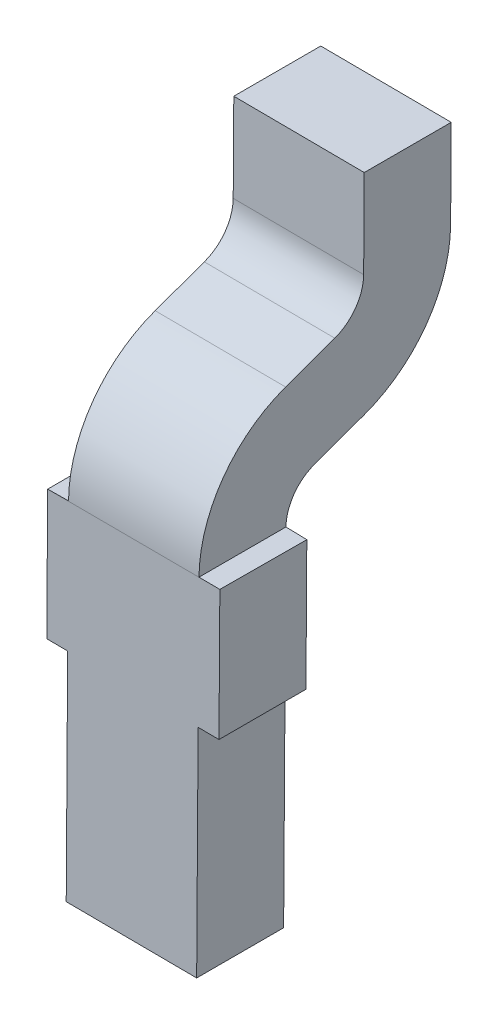
ISO-10303-21;
HEADER;
FILE_DESCRIPTION(('STEP AP214'),'2;1');
FILE_NAME('part.step','',(''),(''),'','','');
FILE_SCHEMA(('AUTOMOTIVE_DESIGN { 1 0 10303 214 1 1 1 1 }'));
ENDSEC;
DATA;
#1=APPLICATION_CONTEXT('core data for automotive mechanical design processes');
#2=APPLICATION_PROTOCOL_DEFINITION('international standard','automotive_design',2000,#1);
#3=PRODUCT_CONTEXT('',#1,'mechanical');
#4=PRODUCT('Part','Part','',(#3));
#5=PRODUCT_RELATED_PRODUCT_CATEGORY('part','',(#4));
#6=PRODUCT_DEFINITION_FORMATION('','',#4);
#7=PRODUCT_DEFINITION_CONTEXT('part definition',#1,'design');
#8=PRODUCT_DEFINITION('design','',#6,#7);
#9=PRODUCT_DEFINITION_SHAPE('','',#8);
#10=(LENGTH_UNIT() NAMED_UNIT(*) SI_UNIT(.MILLI.,.METRE.));
#11=(NAMED_UNIT(*) PLANE_ANGLE_UNIT() SI_UNIT($,.RADIAN.));
#12=(NAMED_UNIT(*) SI_UNIT($,.STERADIAN.) SOLID_ANGLE_UNIT());
#13=UNCERTAINTY_MEASURE_WITH_UNIT(LENGTH_MEASURE(1.E-05),#10,'distance_accuracy_value','');
#14=(GEOMETRIC_REPRESENTATION_CONTEXT(3) GLOBAL_UNCERTAINTY_ASSIGNED_CONTEXT((#13)) GLOBAL_UNIT_ASSIGNED_CONTEXT((#10,
#11,#12)) REPRESENTATION_CONTEXT('',''));
#15=CARTESIAN_POINT('',(0.,0.,0.));
#16=DIRECTION('',(0.,0.,1.));
#17=DIRECTION('',(1.,0.,0.));
#18=AXIS2_PLACEMENT_3D('',#15,#16,#17);
#19=CARTESIAN_POINT('',(204.011590836602,101.63021820341,143.086328634145));
#20=DIRECTION('',(0.99997801670857,-0.00663069374923689,0.));
#21=DIRECTION('',(0.,0.,-1.));
#22=AXIS2_PLACEMENT_3D('',#19,#20,#21);
#23=PLANE('',#22);
#24=DIRECTION('',(0.00663069374923689,0.999978016708569,0.));
#25=VECTOR('',#24,1.);
#26=CARTESIAN_POINT('',(203.999299351482,99.7765336000728,143.151470551509));
#27=LINE('',#26,#25);
#28=CARTESIAN_POINT('',(203.999299351482,99.7765336000728,143.151470551509));
#29=VERTEX_POINT('',#28);
#30=CARTESIAN_POINT('',(204.007602960404,101.02880473421,143.151470551509));
#31=VERTEX_POINT('',#30);
#32=EDGE_CURVE('E67',#29,#31,#27,.T.);
#33=ORIENTED_EDGE('',*,*,#32,.F.);
#34=DIRECTION('',(0.,0.,-1.));
#35=VECTOR('',#34,1.);
#36=CARTESIAN_POINT('',(203.999299351482,99.7765336000728,143.651470551509));
#37=LINE('',#36,#35);
#38=CARTESIAN_POINT('',(203.999299351482,99.7765336000728,143.651470551509));
#39=VERTEX_POINT('',#38);
#40=EDGE_CURVE('E198',#39,#29,#37,.T.);
#41=ORIENTED_EDGE('',*,*,#40,.F.);
#42=DIRECTION('',(-0.00663069374923689,-0.999978016708569,0.));
#43=VECTOR('',#42,1.);
#44=CARTESIAN_POINT('',(204.012560738981,101.77648963349,143.651470551509));
#45=LINE('',#44,#43);
#46=CARTESIAN_POINT('',(204.007602960404,101.02880473421,143.651470551509));
#47=VERTEX_POINT('',#46);
#48=EDGE_CURVE('E278',#47,#39,#45,.T.);
#49=ORIENTED_EDGE('',*,*,#48,.F.);
#50=DIRECTION('',(0.,0.,-1.));
#51=VECTOR('',#50,1.);
#52=CARTESIAN_POINT('',(204.007602960404,101.02880473421,142.648955771372));
#53=LINE('',#52,#51);
#54=EDGE_CURVE('E11',#47,#31,#53,.T.);
#55=ORIENTED_EDGE('',*,*,#54,.T.);
#56=EDGE_LOOP('',(#33,#41,#49,#55));
#57=FACE_BOUND('',#56,.T.);
#58=ADVANCED_FACE('F44',(#57),#23,.F.);
#59=CARTESIAN_POINT('',(205.352573392878,101.019886451118,142.211582908599));
#60=DIRECTION('',(-0.00663069374923689,-0.99997801670857,0.));
#61=DIRECTION('',(-0.99997801670857,0.00663069374923689,0.));
#62=AXIS2_PLACEMENT_3D('',#59,#60,#61);
#63=PLANE('',#62);
#64=ORIENTED_EDGE('',*,*,#54,.F.);
#65=DIRECTION('',(0.999978016708569,-0.00663069374923689,0.));
#66=VECTOR('',#65,1.);
#67=CARTESIAN_POINT('',(205.115078613909,101.021461240883,143.651470551509));
#68=LINE('',#67,#66);
#69=CARTESIAN_POINT('',(203.887605598399,101.02960041746,143.651470551509));
#70=VERTEX_POINT('',#69);
#71=EDGE_CURVE('E304',#70,#47,#68,.T.);
#72=ORIENTED_EDGE('',*,*,#71,.F.);
#73=DIRECTION('',(0.,0.,-1.));
#74=VECTOR('',#73,1.);
#75=CARTESIAN_POINT('',(203.887605598399,101.02960041746,142.648955771372));
#76=LINE('',#75,#74);
#77=CARTESIAN_POINT('',(203.887605598399,101.02960041746,143.151470551509));
#78=VERTEX_POINT('',#77);
#79=EDGE_CURVE('E55',#70,#78,#76,.T.);
#80=ORIENTED_EDGE('',*,*,#79,.T.);
#81=DIRECTION('',(-0.999978016708569,0.00663069374923689,0.));
#82=VECTOR('',#81,1.);
#83=CARTESIAN_POINT('',(205.115078613909,101.021461240883,143.151470551509));
#84=LINE('',#83,#82);
#85=EDGE_CURVE('E270',#31,#78,#84,.T.);
#86=ORIENTED_EDGE('',*,*,#85,.F.);
#87=EDGE_LOOP('',(#64,#72,#80,#86));
#88=FACE_BOUND('',#87,.T.);
#89=ADVANCED_FACE('F500',(#88),#63,.T.);
#90=CARTESIAN_POINT('',(203.891593474597,101.63101388666,143.086328634145));
#91=DIRECTION('',(0.99997801670857,-0.00663069374923689,0.));
#92=DIRECTION('',(0.,0.,-1.));
#93=AXIS2_PLACEMENT_3D('',#90,#91,#92);
#94=PLANE('',#93);
#95=DIRECTION('',(0.00663069374923689,0.999978016708569,0.));
#96=VECTOR('',#95,1.);
#97=CARTESIAN_POINT('',(203.879301989477,99.7773292833227,143.151470551509));
#98=LINE('',#97,#96);
#99=CARTESIAN_POINT('',(203.892563376976,101.77728531674,143.151470551509));
#100=VERTEX_POINT('',#99);
#101=EDGE_CURVE('E274',#78,#100,#98,.T.);
#102=ORIENTED_EDGE('',*,*,#101,.F.);
#103=ORIENTED_EDGE('',*,*,#79,.F.);
#104=DIRECTION('',(-0.00663069374923689,-0.999978016708569,0.));
#105=VECTOR('',#104,1.);
#106=CARTESIAN_POINT('',(203.892563376976,101.77728531674,143.651470551509));
#107=LINE('',#106,#105);
#108=CARTESIAN_POINT('',(203.892563376976,101.77728531674,143.651470551509));
#109=VERTEX_POINT('',#108);
#110=EDGE_CURVE('E308',#109,#70,#107,.T.);
#111=ORIENTED_EDGE('',*,*,#110,.F.);
#112=DIRECTION('',(0.,0.,1.));
#113=VECTOR('',#112,1.);
#114=CARTESIAN_POINT('',(203.892578618711,101.779583929992,142.648955771372));
#115=LINE('',#114,#113);
#116=EDGE_CURVE('E353',#100,#109,#115,.T.);
#117=ORIENTED_EDGE('',*,*,#116,.F.);
#118=EDGE_LOOP('',(#102,#103,#111,#117));
#119=FACE_BOUND('',#118,.T.);
#120=ADVANCED_FACE('F421',(#119),#94,.F.);
#121=CARTESIAN_POINT('',(198.857689304583,101.812969473019,142.211582908599));
#122=DIRECTION('',(0.00663069374923689,0.99997801670857,0.));
#123=DIRECTION('',(0.,0.,-1.));
#124=AXIS2_PLACEMENT_3D('',#121,#122,#123);
#125=PLANE('',#124);
#126=DIRECTION('',(0.,0.,1.));
#127=VECTOR('',#126,1.);
#128=CARTESIAN_POINT('',(204.012575980716,101.778788246742,142.648955771372));
#129=LINE('',#128,#127);
#130=CARTESIAN_POINT('',(204.012575980716,101.778788246742,143.151459983575));
#131=VERTEX_POINT('',#130);
#132=CARTESIAN_POINT('',(204.012575980716,101.778788246742,143.651467028931));
#133=VERTEX_POINT('',#132);
#134=EDGE_CURVE('E240',#131,#133,#129,.T.);
#135=ORIENTED_EDGE('',*,*,#134,.F.);
#136=DIRECTION('',(0.999978016708569,-0.00663069374923689,0.));
#137=VECTOR('',#136,1.);
#138=CARTESIAN_POINT('',(204.882556855252,101.77301954318,143.151459983575));
#139=LINE('',#138,#137);
#140=EDGE_CURVE('E323',#100,#131,#139,.T.);
#141=ORIENTED_EDGE('',*,*,#140,.F.);
#142=ORIENTED_EDGE('',*,*,#116,.T.);
#143=DIRECTION('',(0.999978016708569,-0.00663069374923689,0.));
#144=VECTOR('',#143,1.);
#145=CARTESIAN_POINT('',(204.882556855252,101.77301954318,143.651467028931));
#146=LINE('',#145,#144);
#147=EDGE_CURVE('E251',#109,#133,#146,.T.);
#148=ORIENTED_EDGE('',*,*,#147,.T.);
#149=EDGE_LOOP('',(#135,#141,#142,#148));
#150=FACE_BOUND('',#149,.T.);
#151=ADVANCED_FACE('F425',(#150),#125,.T.);
#152=CARTESIAN_POINT('',(204.011590836602,101.63021820341,143.086328634145));
#153=DIRECTION('',(0.99997801670857,-0.00663069374923689,0.));
#154=DIRECTION('',(0.,0.,-1.));
#155=AXIS2_PLACEMENT_3D('',#152,#153,#154);
#156=PLANE('',#155);
#157=DIRECTION('',(0.00663069374923689,0.999978016708569,0.));
#158=VECTOR('',#157,1.);
#159=CARTESIAN_POINT('',(204.019471902216,102.818765384119,142.211582908599));
#160=LINE('',#159,#158);
#161=CARTESIAN_POINT('',(204.019471902216,102.818765384119,142.211582908599));
#162=VERTEX_POINT('',#161);
#163=CARTESIAN_POINT('',(204.022853556027,103.32875417264,142.211582908599));
#164=VERTEX_POINT('',#163);
#165=EDGE_CURVE('E230',#162,#164,#160,.T.);
#166=ORIENTED_EDGE('',*,*,#165,.F.);
#167=CARTESIAN_POINT('',(204.019471902216,102.818765384119,142.961582908599));
#168=DIRECTION('',(0.99997801670857,-0.00663069374922598,0.));
#169=DIRECTION('',(-0.00623081398683692,-0.939671963249076,-0.342020143325928));
#170=AXIS2_PLACEMENT_3D('',#167,#168,#169);
#171=CIRCLE('',#170,0.749999999999992);
#172=CARTESIAN_POINT('',(204.014798791725,102.114011411682,142.705067801105));
#173=VERTEX_POINT('',#172);
#174=EDGE_CURVE('E160',#173,#162,#171,.T.);
#175=ORIENTED_EDGE('',*,*,#174,.F.);
#176=DIRECTION('',(0.00226783082646436,0.342012624597446,-0.939692620785813));
#177=VECTOR('',#176,1.);
#178=CARTESIAN_POINT('',(204.014118442477,102.011407624303,142.986975587341));
#179=LINE('',#178,#177);
#180=CARTESIAN_POINT('',(204.014118442477,102.011407624303,142.986975587341));
#181=VERTEX_POINT('',#180);
#182=EDGE_CURVE('E232',#181,#173,#179,.T.);
#183=ORIENTED_EDGE('',*,*,#182,.F.);
#184=CARTESIAN_POINT('',(204.012560738981,101.77648963349,142.901470551509));
#185=DIRECTION('',(-0.99997801670857,0.00663069374923689,0.));
#186=DIRECTION('',(0.,0.,1.));
#187=AXIS2_PLACEMENT_3D('',#184,#185,#186);
#188=CIRCLE('',#187,0.25);
#189=EDGE_CURVE('E172',#131,#181,#188,.T.);
#190=ORIENTED_EDGE('',*,*,#189,.F.);
#191=ORIENTED_EDGE('',*,*,#134,.T.);
#192=CARTESIAN_POINT('',(204.012560738981,101.77648963349,142.901470551509));
#193=DIRECTION('',(0.99997801670857,-0.00663069374922598,0.));
#194=DIRECTION('',(0.00623081398683692,0.939671963249076,0.342020143325928));
#195=AXIS2_PLACEMENT_3D('',#192,#193,#194);
#196=CIRCLE('',#195,0.749999999999992);
#197=CARTESIAN_POINT('',(204.017233849471,102.481243605927,143.157985659003));
#198=VERTEX_POINT('',#197);
#199=EDGE_CURVE('E292',#198,#133,#196,.T.);
#200=ORIENTED_EDGE('',*,*,#199,.F.);
#201=DIRECTION('',(-0.00226783082646436,-0.342012624597446,0.939692620785813));
#202=VECTOR('',#201,1.);
#203=CARTESIAN_POINT('',(204.017914198719,102.583847393307,142.876077872768));
#204=LINE('',#203,#202);
#205=CARTESIAN_POINT('',(204.017914198719,102.583847393307,142.876077872768));
#206=VERTEX_POINT('',#205);
#207=EDGE_CURVE('E265',#206,#198,#204,.T.);
#208=ORIENTED_EDGE('',*,*,#207,.F.);
#209=CARTESIAN_POINT('',(204.019471902216,102.818765384119,142.961582908599));
#210=DIRECTION('',(-0.99997801670857,0.00663069374923689,0.));
#211=DIRECTION('',(0.,0.,-1.));
#212=AXIS2_PLACEMENT_3D('',#209,#210,#211);
#213=CIRCLE('',#212,0.25);
#214=CARTESIAN_POINT('',(204.019471902216,102.818765384119,142.711582908599));
#215=VERTEX_POINT('',#214);
#216=EDGE_CURVE('E260',#215,#206,#213,.T.);
#217=ORIENTED_EDGE('',*,*,#216,.F.);
#218=DIRECTION('',(-0.00663069374923689,-0.999978016708569,0.));
#219=VECTOR('',#218,1.);
#220=CARTESIAN_POINT('',(204.022853556027,103.32875417264,142.711582908599));
#221=LINE('',#220,#219);
#222=CARTESIAN_POINT('',(204.022853556027,103.32875417264,142.711582908599));
#223=VERTEX_POINT('',#222);
#224=EDGE_CURVE('E241',#223,#215,#221,.T.);
#225=ORIENTED_EDGE('',*,*,#224,.F.);
#226=DIRECTION('',(0.,0.,1.));
#227=VECTOR('',#226,1.);
#228=CARTESIAN_POINT('',(204.022853556027,103.32875417264,142.211582908599));
#229=LINE('',#228,#227);
#230=EDGE_CURVE('E331',#164,#223,#229,.T.);
#231=ORIENTED_EDGE('',*,*,#230,.F.);
#232=EDGE_LOOP('',(#166,#175,#183,#190,#191,#200,#208,#217,#225,#231));
#233=FACE_BOUND('',#232,.T.);
#234=ADVANCED_FACE('F462',(#233),#156,.F.);
#235=CARTESIAN_POINT('',(204.772837068559,103.323781152328,142.711582908599));
#236=DIRECTION('',(0.,0.,1.));
#237=DIRECTION('',(1.,0.,0.));
#238=AXIS2_PLACEMENT_3D('',#235,#236,#237);
#239=PLANE('',#238);
#240=DIRECTION('',(-0.999978016708569,0.00663069374923689,0.));
#241=VECTOR('',#240,1.);
#242=CARTESIAN_POINT('',(204.772837068559,103.323781152328,142.711582908599));
#243=LINE('',#242,#241);
#244=CARTESIAN_POINT('',(204.772837068559,103.323781152328,142.711582908599));
#245=VERTEX_POINT('',#244);
#246=EDGE_CURVE('E236',#245,#223,#243,.T.);
#247=ORIENTED_EDGE('',*,*,#246,.T.);
#248=ORIENTED_EDGE('',*,*,#224,.T.);
#249=DIRECTION('',(-0.999978016708569,0.00663069374923689,0.));
#250=VECTOR('',#249,1.);
#251=CARTESIAN_POINT('',(204.769455414747,102.813792363807,142.711582908599));
#252=LINE('',#251,#250);
#253=CARTESIAN_POINT('',(204.769455414747,102.813792363807,142.711582908599));
#254=VERTEX_POINT('',#253);
#255=EDGE_CURVE('E256',#254,#215,#252,.T.);
#256=ORIENTED_EDGE('',*,*,#255,.F.);
#257=DIRECTION('',(-0.00663069374923689,-0.999978016708569,0.));
#258=VECTOR('',#257,1.);
#259=CARTESIAN_POINT('',(204.772837068559,103.323781152328,142.711582908599));
#260=LINE('',#259,#258);
#261=EDGE_CURVE('E264',#245,#254,#260,.T.);
#262=ORIENTED_EDGE('',*,*,#261,.F.);
#263=EDGE_LOOP('',(#247,#248,#256,#262));
#264=FACE_BOUND('',#263,.T.);
#265=ADVANCED_FACE('F543',(#264),#239,.T.);
#266=CARTESIAN_POINT('',(204.769455414747,102.813792363807,142.961582908599));
#267=DIRECTION('',(0.99997801670857,-0.00663069374923689,0.));
#268=DIRECTION('',(0.,0.,-1.));
#269=AXIS2_PLACEMENT_3D('',#266,#267,#268);
#270=CYLINDRICAL_SURFACE('',#269,0.25);
#271=ORIENTED_EDGE('',*,*,#255,.T.);
#272=ORIENTED_EDGE('',*,*,#216,.T.);
#273=DIRECTION('',(-0.999978016708569,0.00663069374923689,0.));
#274=VECTOR('',#273,1.);
#275=CARTESIAN_POINT('',(204.76789771125,102.578874372995,142.876077872768));
#276=LINE('',#275,#274);
#277=CARTESIAN_POINT('',(204.76789771125,102.578874372995,142.876077872768));
#278=VERTEX_POINT('',#277);
#279=EDGE_CURVE('E269',#278,#206,#276,.T.);
#280=ORIENTED_EDGE('',*,*,#279,.F.);
#281=CARTESIAN_POINT('',(204.769455414747,102.813792363807,142.961582908599));
#282=DIRECTION('',(-0.99997801670857,0.00663069374923689,0.));
#283=DIRECTION('',(0.,0.,-1.));
#284=AXIS2_PLACEMENT_3D('',#281,#282,#283);
#285=CIRCLE('',#284,0.25);
#286=EDGE_CURVE('E246',#254,#278,#285,.T.);
#287=ORIENTED_EDGE('',*,*,#286,.F.);
#288=EDGE_LOOP('',(#271,#272,#280,#287));
#289=FACE_BOUND('',#288,.T.);
#290=ADVANCED_FACE('F538',(#289),#270,.F.);
#291=CARTESIAN_POINT('',(204.76789771125,102.578874372995,142.876077872768));
#292=DIRECTION('',(0.00623081398684852,0.939671963249075,0.342020143325932));
#293=DIRECTION('',(0.99983409933677,0.,-0.0182146590259127));
#294=AXIS2_PLACEMENT_3D('',#291,#292,#293);
#295=PLANE('',#294);
#296=ORIENTED_EDGE('',*,*,#279,.T.);
#297=ORIENTED_EDGE('',*,*,#207,.T.);
#298=DIRECTION('',(-0.999978016708569,0.00663069374923689,0.));
#299=VECTOR('',#298,1.);
#300=CARTESIAN_POINT('',(204.767217362002,102.476270585615,143.157985659003));
#301=LINE('',#300,#299);
#302=CARTESIAN_POINT('',(204.767217362002,102.476270585615,143.157985659003));
#303=VERTEX_POINT('',#302);
#304=EDGE_CURVE('E296',#303,#198,#301,.T.);
#305=ORIENTED_EDGE('',*,*,#304,.F.);
#306=DIRECTION('',(-0.00226783082646436,-0.342012624597446,0.939692620785813));
#307=VECTOR('',#306,1.);
#308=CARTESIAN_POINT('',(204.76789771125,102.578874372995,142.876077872768));
#309=LINE('',#308,#307);
#310=EDGE_CURVE('E242',#278,#303,#309,.T.);
#311=ORIENTED_EDGE('',*,*,#310,.F.);
#312=EDGE_LOOP('',(#296,#297,#305,#311));
#313=FACE_BOUND('',#312,.T.);
#314=ADVANCED_FACE('F532',(#313),#295,.T.);
#315=CARTESIAN_POINT('',(204.764101955009,102.006434603991,142.986975587341));
#316=DIRECTION('',(-0.00623081398684852,-0.939671963249075,-0.342020143325932));
#317=DIRECTION('',(0.,0.342026782650606,-0.939690204242693));
#318=AXIS2_PLACEMENT_3D('',#315,#316,#317);
#319=PLANE('',#318);
#320=DIRECTION('',(-0.999978016708569,0.00663069374923689,0.));
#321=VECTOR('',#320,1.);
#322=CARTESIAN_POINT('',(204.764101955009,102.006434603991,142.986975587341));
#323=LINE('',#322,#321);
#324=CARTESIAN_POINT('',(204.764101955009,102.006434603991,142.986975587341));
#325=VERTEX_POINT('',#324);
#326=EDGE_CURVE('E234',#325,#181,#323,.T.);
#327=ORIENTED_EDGE('',*,*,#326,.T.);
#328=ORIENTED_EDGE('',*,*,#182,.T.);
#329=DIRECTION('',(-0.999978016708569,0.00663069374923689,0.));
#330=VECTOR('',#329,1.);
#331=CARTESIAN_POINT('',(204.764782304257,102.10903839137,142.705067801105));
#332=LINE('',#331,#330);
#333=CARTESIAN_POINT('',(204.764782304257,102.10903839137,142.705067801105));
#334=VERTEX_POINT('',#333);
#335=EDGE_CURVE('E235',#334,#173,#332,.T.);
#336=ORIENTED_EDGE('',*,*,#335,.F.);
#337=DIRECTION('',(0.00226783082646436,0.342012624597446,-0.939692620785813));
#338=VECTOR('',#337,1.);
#339=CARTESIAN_POINT('',(204.764101955009,102.006434603991,142.986975587341));
#340=LINE('',#339,#338);
#341=EDGE_CURVE('E298',#325,#334,#340,.T.);
#342=ORIENTED_EDGE('',*,*,#341,.F.);
#343=EDGE_LOOP('',(#327,#328,#336,#342));
#344=FACE_BOUND('',#343,.T.);
#345=ADVANCED_FACE('F490',(#344),#319,.T.);
#346=CARTESIAN_POINT('',(204.769455414747,102.813792363807,142.961582908599));
#347=DIRECTION('',(0.99997801670857,-0.00663069374922598,0.));
#348=DIRECTION('',(-0.00623081398683692,-0.939671963249076,-0.342020143325928));
#349=AXIS2_PLACEMENT_3D('',#346,#347,#348);
#350=CYLINDRICAL_SURFACE('',#349,0.749999999999992);
#351=ORIENTED_EDGE('',*,*,#335,.T.);
#352=ORIENTED_EDGE('',*,*,#174,.T.);
#353=DIRECTION('',(-0.999978016708569,0.00663069374923689,0.));
#354=VECTOR('',#353,1.);
#355=CARTESIAN_POINT('',(204.769455414747,102.813792363807,142.211582908599));
#356=LINE('',#355,#354);
#357=CARTESIAN_POINT('',(204.769455414747,102.813792363807,142.211582908599));
#358=VERTEX_POINT('',#357);
#359=EDGE_CURVE('E314',#358,#162,#356,.T.);
#360=ORIENTED_EDGE('',*,*,#359,.F.);
#361=CARTESIAN_POINT('',(204.769455414747,102.813792363807,142.961582908599));
#362=DIRECTION('',(0.99997801670857,-0.00663069374922598,0.));
#363=DIRECTION('',(-0.00623081398683692,-0.939671963249076,-0.342020143325928));
#364=AXIS2_PLACEMENT_3D('',#361,#362,#363);
#365=CIRCLE('',#364,0.749999999999992);
#366=EDGE_CURVE('E303',#334,#358,#365,.T.);
#367=ORIENTED_EDGE('',*,*,#366,.F.);
#368=EDGE_LOOP('',(#351,#352,#360,#367));
#369=FACE_BOUND('',#368,.T.);
#370=ADVANCED_FACE('F531',(#369),#350,.T.);
#371=CARTESIAN_POINT('',(204.769455414747,102.813792363807,142.211582908599));
#372=DIRECTION('',(0.,0.,-1.));
#373=DIRECTION('',(0.,-1.,0.));
#374=AXIS2_PLACEMENT_3D('',#371,#372,#373);
#375=PLANE('',#374);
#376=ORIENTED_EDGE('',*,*,#359,.T.);
#377=ORIENTED_EDGE('',*,*,#165,.T.);
#378=DIRECTION('',(-0.999978016708569,0.00663069374923689,0.));
#379=VECTOR('',#378,1.);
#380=CARTESIAN_POINT('',(204.772837068559,103.323781152328,142.211582908599));
#381=LINE('',#380,#379);
#382=CARTESIAN_POINT('',(204.772837068559,103.323781152328,142.211582908599));
#383=VERTEX_POINT('',#382);
#384=EDGE_CURVE('E347',#383,#164,#381,.T.);
#385=ORIENTED_EDGE('',*,*,#384,.F.);
#386=DIRECTION('',(0.00663069374923689,0.999978016708569,0.));
#387=VECTOR('',#386,1.);
#388=CARTESIAN_POINT('',(204.769455414747,102.813792363807,142.211582908599));
#389=LINE('',#388,#387);
#390=EDGE_CURVE('E185',#358,#383,#389,.T.);
#391=ORIENTED_EDGE('',*,*,#390,.F.);
#392=EDGE_LOOP('',(#376,#377,#385,#391));
#393=FACE_BOUND('',#392,.T.);
#394=ADVANCED_FACE('F469',(#393),#375,.T.);
#395=CARTESIAN_POINT('',(204.772837068559,103.323781152328,142.211582908599));
#396=DIRECTION('',(0.00663069374923689,0.99997801670857,0.));
#397=DIRECTION('',(2.67899092701187E-13,0.,-1.));
#398=AXIS2_PLACEMENT_3D('',#395,#396,#397);
#399=PLANE('',#398);
#400=ORIENTED_EDGE('',*,*,#384,.T.);
#401=ORIENTED_EDGE('',*,*,#230,.T.);
#402=ORIENTED_EDGE('',*,*,#246,.F.);
#403=DIRECTION('',(0.,0.,1.));
#404=VECTOR('',#403,1.);
#405=CARTESIAN_POINT('',(204.772837068559,103.323781152328,142.211582908599));
#406=LINE('',#405,#404);
#407=EDGE_CURVE('E280',#383,#245,#406,.T.);
#408=ORIENTED_EDGE('',*,*,#407,.F.);
#409=EDGE_LOOP('',(#400,#401,#402,#408));
#410=FACE_BOUND('',#409,.T.);
#411=ADVANCED_FACE('F472',(#410),#399,.T.);
#412=CARTESIAN_POINT('',(204.749282864013,99.7715605797609,143.651470551509));
#413=DIRECTION('',(-0.00663069374923689,-0.99997801670857,0.));
#414=DIRECTION('',(-0.99997801670857,0.00663069374923689,0.));
#415=AXIS2_PLACEMENT_3D('',#412,#413,#414);
#416=PLANE('',#415);
#417=DIRECTION('',(-0.999978016708569,0.00663069374923689,0.));
#418=VECTOR('',#417,1.);
#419=CARTESIAN_POINT('',(204.749282864013,99.7715605797609,143.651470551509));
#420=LINE('',#419,#418);
#421=CARTESIAN_POINT('',(204.749282864013,99.7715605797609,143.651470551509));
#422=VERTEX_POINT('',#421);
#423=EDGE_CURVE('E285',#422,#39,#420,.T.);
#424=ORIENTED_EDGE('',*,*,#423,.T.);
#425=ORIENTED_EDGE('',*,*,#40,.T.);
#426=DIRECTION('',(-0.999978016708569,0.00663069374923689,0.));
#427=VECTOR('',#426,1.);
#428=CARTESIAN_POINT('',(204.749282864013,99.7715605797609,143.151470551509));
#429=LINE('',#428,#427);
#430=CARTESIAN_POINT('',(204.749282864013,99.7715605797609,143.151470551509));
#431=VERTEX_POINT('',#430);
#432=EDGE_CURVE('E192',#431,#29,#429,.T.);
#433=ORIENTED_EDGE('',*,*,#432,.F.);
#434=DIRECTION('',(0.,0.,-1.));
#435=VECTOR('',#434,1.);
#436=CARTESIAN_POINT('',(204.749282864013,99.7715605797609,143.651470551509));
#437=LINE('',#436,#435);
#438=EDGE_CURVE('E196',#422,#431,#437,.T.);
#439=ORIENTED_EDGE('',*,*,#438,.F.);
#440=EDGE_LOOP('',(#424,#425,#433,#439));
#441=FACE_BOUND('',#440,.T.);
#442=ADVANCED_FACE('F195',(#441),#416,.T.);
#443=CARTESIAN_POINT('',(204.761574349133,101.625245183098,143.086328634145));
#444=DIRECTION('',(0.99997801670857,-0.00663069374923689,0.));
#445=DIRECTION('',(0.,0.,-1.));
#446=AXIS2_PLACEMENT_3D('',#443,#444,#445);
#447=PLANE('',#446);
#448=ORIENTED_EDGE('',*,*,#407,.T.);
#449=ORIENTED_EDGE('',*,*,#261,.T.);
#450=ORIENTED_EDGE('',*,*,#286,.T.);
#451=ORIENTED_EDGE('',*,*,#310,.T.);
#452=CARTESIAN_POINT('',(204.762544251512,101.771516613178,142.901470551509));
#453=DIRECTION('',(0.99997801670857,-0.00663069374922598,0.));
#454=DIRECTION('',(0.00623081398683692,0.939671963249076,0.342020143325928));
#455=AXIS2_PLACEMENT_3D('',#452,#453,#454);
#456=CIRCLE('',#455,0.749999999999992);
#457=CARTESIAN_POINT('',(204.762559493247,101.77381522643,143.651467028931));
#458=VERTEX_POINT('',#457);
#459=EDGE_CURVE('E247',#303,#458,#456,.T.);
#460=ORIENTED_EDGE('',*,*,#459,.T.);
#461=DIRECTION('',(0.,0.,1.));
#462=VECTOR('',#461,1.);
#463=CARTESIAN_POINT('',(204.762559493247,101.77381522643,142.648955771372));
#464=LINE('',#463,#462);
#465=CARTESIAN_POINT('',(204.762559493247,101.77381522643,143.151459983575));
#466=VERTEX_POINT('',#465);
#467=EDGE_CURVE('E219',#466,#458,#464,.T.);
#468=ORIENTED_EDGE('',*,*,#467,.F.);
#469=CARTESIAN_POINT('',(204.762544251512,101.771516613178,142.901470551509));
#470=DIRECTION('',(-0.99997801670857,0.00663069374923689,0.));
#471=DIRECTION('',(0.,0.,1.));
#472=AXIS2_PLACEMENT_3D('',#469,#470,#471);
#473=CIRCLE('',#472,0.25);
#474=EDGE_CURVE('E302',#466,#325,#473,.T.);
#475=ORIENTED_EDGE('',*,*,#474,.T.);
#476=ORIENTED_EDGE('',*,*,#341,.T.);
#477=ORIENTED_EDGE('',*,*,#366,.T.);
#478=ORIENTED_EDGE('',*,*,#390,.T.);
#479=EDGE_LOOP('',(#448,#449,#450,#451,#460,#468,#475,#476,#477,#478));
#480=FACE_BOUND('',#479,.T.);
#481=ADVANCED_FACE('F435',(#480),#447,.T.);
#482=CARTESIAN_POINT('',(204.761574349133,101.625245183098,143.086328634145));
#483=DIRECTION('',(0.99997801670857,-0.00663069374923689,0.));
#484=DIRECTION('',(0.,0.,-1.));
#485=AXIS2_PLACEMENT_3D('',#482,#483,#484);
#486=PLANE('',#485);
#487=DIRECTION('',(0.,0.,-1.));
#488=VECTOR('',#487,1.);
#489=CARTESIAN_POINT('',(204.757586472935,101.023831713898,142.648955771372));
#490=LINE('',#489,#488);
#491=CARTESIAN_POINT('',(204.757586472935,101.023831713898,143.651470551509));
#492=VERTEX_POINT('',#491);
#493=CARTESIAN_POINT('',(204.757586472935,101.023831713898,143.151470551509));
#494=VERTEX_POINT('',#493);
#495=EDGE_CURVE('E279',#492,#494,#490,.T.);
#496=ORIENTED_EDGE('',*,*,#495,.F.);
#497=DIRECTION('',(-0.00663069374923689,-0.999978016708569,0.));
#498=VECTOR('',#497,1.);
#499=CARTESIAN_POINT('',(204.762544251512,101.771516613178,143.651470551509));
#500=LINE('',#499,#498);
#501=EDGE_CURVE('E212',#492,#422,#500,.T.);
#502=ORIENTED_EDGE('',*,*,#501,.T.);
#503=ORIENTED_EDGE('',*,*,#438,.T.);
#504=DIRECTION('',(0.00663069374923689,0.999978016708569,0.));
#505=VECTOR('',#504,1.);
#506=CARTESIAN_POINT('',(204.749282864013,99.7715605797609,143.151470551509));
#507=LINE('',#506,#505);
#508=EDGE_CURVE('E209',#431,#494,#507,.T.);
#509=ORIENTED_EDGE('',*,*,#508,.T.);
#510=EDGE_LOOP('',(#496,#502,#503,#509));
#511=FACE_BOUND('',#510,.T.);
#512=ADVANCED_FACE('F208',(#511),#486,.T.);
#513=CARTESIAN_POINT('',(198.857689304583,101.812969473019,142.211582908599));
#514=DIRECTION('',(0.00663069374923689,0.99997801670857,0.));
#515=DIRECTION('',(0.,0.,-1.));
#516=AXIS2_PLACEMENT_3D('',#513,#514,#515);
#517=PLANE('',#516);
#518=DIRECTION('',(0.,0.,1.));
#519=VECTOR('',#518,1.);
#520=CARTESIAN_POINT('',(204.882556855252,101.77301954318,142.648955771372));
#521=LINE('',#520,#519);
#522=CARTESIAN_POINT('',(204.882541613517,101.770720929928,143.151470551509));
#523=VERTEX_POINT('',#522);
#524=CARTESIAN_POINT('',(204.882556855252,101.77301954318,143.651467028931));
#525=VERTEX_POINT('',#524);
#526=EDGE_CURVE('E106',#523,#525,#521,.T.);
#527=ORIENTED_EDGE('',*,*,#526,.F.);
#528=DIRECTION('',(0.999978016708569,-0.00663069374923689,0.));
#529=VECTOR('',#528,1.);
#530=CARTESIAN_POINT('',(204.882556855252,101.77301954318,143.151459983575));
#531=LINE('',#530,#529);
#532=EDGE_CURVE('E324',#466,#523,#531,.T.);
#533=ORIENTED_EDGE('',*,*,#532,.F.);
#534=ORIENTED_EDGE('',*,*,#467,.T.);
#535=DIRECTION('',(0.999978016708569,-0.00663069374923689,0.));
#536=VECTOR('',#535,1.);
#537=CARTESIAN_POINT('',(204.882556855252,101.77301954318,143.651467028931));
#538=LINE('',#537,#536);
#539=EDGE_CURVE('E226',#458,#525,#538,.T.);
#540=ORIENTED_EDGE('',*,*,#539,.T.);
#541=EDGE_LOOP('',(#527,#533,#534,#540));
#542=FACE_BOUND('',#541,.T.);
#543=ADVANCED_FACE('F432',(#542),#517,.T.);
#544=CARTESIAN_POINT('',(204.882541613517,101.770720929928,142.901470551509));
#545=DIRECTION('',(0.99997801670857,-0.00663069374922598,0.));
#546=DIRECTION('',(0.00623081398683692,0.939671963249076,0.342020143325928));
#547=AXIS2_PLACEMENT_3D('',#544,#545,#546);
#548=CYLINDRICAL_SURFACE('',#547,0.749999999999992);
#549=DIRECTION('',(-0.999978016708569,0.00663069374923689,0.));
#550=VECTOR('',#549,1.);
#551=CARTESIAN_POINT('',(204.882541613517,101.770720929928,143.651470551509));
#552=LINE('',#551,#550);
#553=EDGE_CURVE('E297',#525,#109,#552,.T.);
#554=ORIENTED_EDGE('',*,*,#553,.F.);
#555=ORIENTED_EDGE('',*,*,#539,.F.);
#556=ORIENTED_EDGE('',*,*,#459,.F.);
#557=ORIENTED_EDGE('',*,*,#304,.T.);
#558=ORIENTED_EDGE('',*,*,#199,.T.);
#559=ORIENTED_EDGE('',*,*,#147,.F.);
#560=EDGE_LOOP('',(#554,#555,#556,#557,#558,#559));
#561=FACE_BOUND('',#560,.T.);
#562=ADVANCED_FACE('F430',(#561),#548,.T.);
#563=CARTESIAN_POINT('',(204.882541613517,101.770720929928,143.651470551509));
#564=DIRECTION('',(0.,0.,1.));
#565=DIRECTION('',(1.,0.,0.));
#566=AXIS2_PLACEMENT_3D('',#563,#564,#565);
#567=PLANE('',#566);
#568=DIRECTION('',(-0.00663069374923689,-0.999978016708569,0.));
#569=VECTOR('',#568,1.);
#570=CARTESIAN_POINT('',(204.882541613517,101.770720929928,143.651470551509));
#571=LINE('',#570,#569);
#572=CARTESIAN_POINT('',(204.877583834941,101.023036030648,143.651470551509));
#573=VERTEX_POINT('',#572);
#574=EDGE_CURVE('E119',#525,#573,#571,.T.);
#575=ORIENTED_EDGE('',*,*,#574,.F.);
#576=ORIENTED_EDGE('',*,*,#553,.T.);
#577=ORIENTED_EDGE('',*,*,#110,.T.);
#578=ORIENTED_EDGE('',*,*,#71,.T.);
#579=ORIENTED_EDGE('',*,*,#48,.T.);
#580=ORIENTED_EDGE('',*,*,#423,.F.);
#581=ORIENTED_EDGE('',*,*,#501,.F.);
#582=DIRECTION('',(0.999978016708569,-0.00663069374923689,0.));
#583=VECTOR('',#582,1.);
#584=CARTESIAN_POINT('',(205.115078613909,101.021461240883,143.651470551509));
#585=LINE('',#584,#583);
#586=EDGE_CURVE('E275',#492,#573,#585,.T.);
#587=ORIENTED_EDGE('',*,*,#586,.T.);
#588=EDGE_LOOP('',(#575,#576,#577,#578,#579,#580,#581,#587));
#589=FACE_BOUND('',#588,.T.);
#590=ADVANCED_FACE('F427',(#589),#567,.T.);
#591=CARTESIAN_POINT('',(205.352573392878,101.019886451118,142.211582908599));
#592=DIRECTION('',(-0.00663069374923689,-0.99997801670857,0.));
#593=DIRECTION('',(-0.99997801670857,0.00663069374923689,0.));
#594=AXIS2_PLACEMENT_3D('',#591,#592,#593);
#595=PLANE('',#594);
#596=DIRECTION('',(0.,0.,-1.));
#597=VECTOR('',#596,1.);
#598=CARTESIAN_POINT('',(204.877583834941,101.023036030648,142.648955771372));
#599=LINE('',#598,#597);
#600=CARTESIAN_POINT('',(204.877583834941,101.023036030648,143.151470551509));
#601=VERTEX_POINT('',#600);
#602=EDGE_CURVE('E252',#573,#601,#599,.T.);
#603=ORIENTED_EDGE('',*,*,#602,.F.);
#604=ORIENTED_EDGE('',*,*,#586,.F.);
#605=ORIENTED_EDGE('',*,*,#495,.T.);
#606=DIRECTION('',(-0.999978016708569,0.00663069374923689,0.));
#607=VECTOR('',#606,1.);
#608=CARTESIAN_POINT('',(205.115078613909,101.021461240883,143.151470551509));
#609=LINE('',#608,#607);
#610=EDGE_CURVE('E202',#601,#494,#609,.T.);
#611=ORIENTED_EDGE('',*,*,#610,.F.);
#612=EDGE_LOOP('',(#603,#604,#605,#611));
#613=FACE_BOUND('',#612,.T.);
#614=ADVANCED_FACE('F505',(#613),#595,.T.);
#615=CARTESIAN_POINT('',(204.869280226019,99.770764896511,143.151470551509));
#616=DIRECTION('',(0.,0.,-1.));
#617=DIRECTION('',(-1.,0.,0.));
#618=AXIS2_PLACEMENT_3D('',#615,#616,#617);
#619=PLANE('',#618);
#620=DIRECTION('',(0.00663069374923689,0.999978016708569,0.));
#621=VECTOR('',#620,1.);
#622=CARTESIAN_POINT('',(204.869280226019,99.770764896511,143.151470551509));
#623=LINE('',#622,#621);
#624=EDGE_CURVE('E255',#601,#523,#623,.T.);
#625=ORIENTED_EDGE('',*,*,#624,.F.);
#626=ORIENTED_EDGE('',*,*,#610,.T.);
#627=ORIENTED_EDGE('',*,*,#508,.F.);
#628=ORIENTED_EDGE('',*,*,#432,.T.);
#629=ORIENTED_EDGE('',*,*,#32,.T.);
#630=ORIENTED_EDGE('',*,*,#85,.T.);
#631=ORIENTED_EDGE('',*,*,#101,.T.);
#632=DIRECTION('',(-0.999978016708569,0.00663069374923689,0.));
#633=VECTOR('',#632,1.);
#634=CARTESIAN_POINT('',(204.882541613517,101.770720929928,143.151470551509));
#635=LINE('',#634,#633);
#636=EDGE_CURVE('E379',#523,#100,#635,.T.);
#637=ORIENTED_EDGE('',*,*,#636,.F.);
#638=EDGE_LOOP('',(#625,#626,#627,#628,#629,#630,#631,#637));
#639=FACE_BOUND('',#638,.T.);
#640=ADVANCED_FACE('F216',(#639),#619,.T.);
#641=CARTESIAN_POINT('',(204.882541613517,101.770720929928,142.901470551509));
#642=DIRECTION('',(0.99997801670857,-0.00663069374923689,0.));
#643=DIRECTION('',(0.,0.,1.));
#644=AXIS2_PLACEMENT_3D('',#641,#642,#643);
#645=CYLINDRICAL_SURFACE('',#644,0.25);
#646=ORIENTED_EDGE('',*,*,#636,.T.);
#647=ORIENTED_EDGE('',*,*,#140,.T.);
#648=ORIENTED_EDGE('',*,*,#189,.T.);
#649=ORIENTED_EDGE('',*,*,#326,.F.);
#650=ORIENTED_EDGE('',*,*,#474,.F.);
#651=ORIENTED_EDGE('',*,*,#532,.T.);
#652=EDGE_LOOP('',(#646,#647,#648,#649,#650,#651));
#653=FACE_BOUND('',#652,.T.);
#654=ADVANCED_FACE('F46',(#653),#645,.F.);
#655=CARTESIAN_POINT('',(204.881571711138,101.624449499848,143.086328634145));
#656=DIRECTION('',(0.99997801670857,-0.00663069374923689,0.));
#657=DIRECTION('',(0.,0.,-1.));
#658=AXIS2_PLACEMENT_3D('',#655,#656,#657);
#659=PLANE('',#658);
#660=ORIENTED_EDGE('',*,*,#526,.T.);
#661=ORIENTED_EDGE('',*,*,#574,.T.);
#662=ORIENTED_EDGE('',*,*,#602,.T.);
#663=ORIENTED_EDGE('',*,*,#624,.T.);
#664=EDGE_LOOP('',(#660,#661,#662,#663));
#665=FACE_BOUND('',#664,.T.);
#666=ADVANCED_FACE('F506',(#665),#659,.T.);
#667=CLOSED_SHELL('',(#58,#89,#120,#151,#234,#265,#290,#314,#345,#370,#394,#411,#442,#481,#512,
#543,#562,#590,#614,#640,#654,#666));
#668=MANIFOLD_SOLID_BREP('B2',#667);
#669=ADVANCED_BREP_SHAPE_REPRESENTATION('',(#18,#668),#14);
#670=SHAPE_DEFINITION_REPRESENTATION(#9,#669);
ENDSEC;
END-ISO-10303-21;
